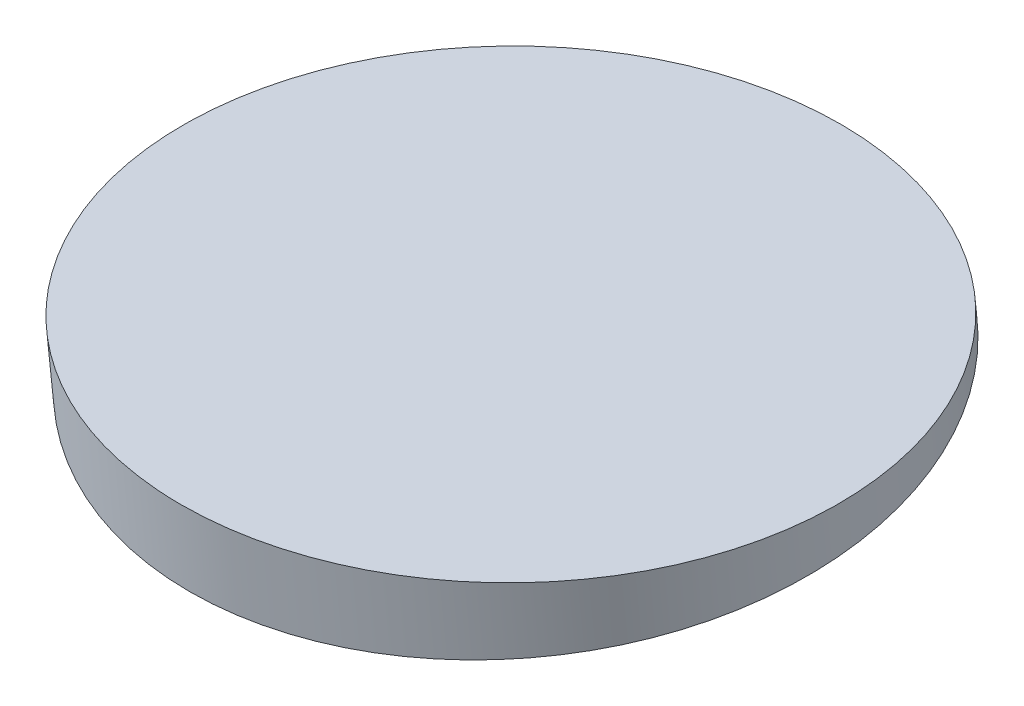
ISO-10303-21;
HEADER;
FILE_DESCRIPTION(('STEP AP214'),'2;1');
FILE_NAME('part.step','',(''),(''),'','','');
FILE_SCHEMA(('AUTOMOTIVE_DESIGN { 1 0 10303 214 1 1 1 1 }'));
ENDSEC;
DATA;
#1=APPLICATION_CONTEXT('core data for automotive mechanical design processes');
#2=APPLICATION_PROTOCOL_DEFINITION('international standard','automotive_design',2000,#1);
#3=PRODUCT_CONTEXT('',#1,'mechanical');
#4=PRODUCT('Part','Part','',(#3));
#5=PRODUCT_RELATED_PRODUCT_CATEGORY('part','',(#4));
#6=PRODUCT_DEFINITION_FORMATION('','',#4);
#7=PRODUCT_DEFINITION_CONTEXT('part definition',#1,'design');
#8=PRODUCT_DEFINITION('design','',#6,#7);
#9=PRODUCT_DEFINITION_SHAPE('','',#8);
#10=(LENGTH_UNIT() NAMED_UNIT(*) SI_UNIT(.MILLI.,.METRE.));
#11=(NAMED_UNIT(*) PLANE_ANGLE_UNIT() SI_UNIT($,.RADIAN.));
#12=(NAMED_UNIT(*) SI_UNIT($,.STERADIAN.) SOLID_ANGLE_UNIT());
#13=UNCERTAINTY_MEASURE_WITH_UNIT(LENGTH_MEASURE(1.E-05),#10,'distance_accuracy_value','');
#14=(GEOMETRIC_REPRESENTATION_CONTEXT(3) GLOBAL_UNCERTAINTY_ASSIGNED_CONTEXT((#13)) GLOBAL_UNIT_ASSIGNED_CONTEXT((#10,
#11,#12)) REPRESENTATION_CONTEXT('',''));
#15=CARTESIAN_POINT('',(0.,0.,0.));
#16=DIRECTION('',(0.,0.,1.));
#17=DIRECTION('',(1.,0.,0.));
#18=AXIS2_PLACEMENT_3D('',#15,#16,#17);
#19=CARTESIAN_POINT('',(-132.804,5386.85755819517,-698.319253830587));
#20=DIRECTION('',(0.,1.,0.));
#21=DIRECTION('',(0.,0.,1.));
#22=AXIS2_PLACEMENT_3D('',#19,#20,#21);
#23=PLANE('',#22);
#24=CARTESIAN_POINT('',(6.53755481226089E-13,5386.85755819517,-698.319253830586));
#25=DIRECTION('',(0.,1.,0.));
#26=DIRECTION('',(1.0650171153038E-12,0.,1.));
#27=AXIS2_PLACEMENT_3D('',#24,#25,#26);
#28=ELLIPSE('',#27,65.3580381716292,64.9999999999999);
#29=CARTESIAN_POINT('',(7.02611847566904E-11,5386.85755819517,-632.961215658956));
#30=VERTEX_POINT('',#29);
#31=EDGE_CURVE('E19',#30,#30,#28,.F.);
#32=ORIENTED_EDGE('',*,*,#31,.F.);
#33=EDGE_LOOP('',(#32));
#34=FACE_BOUND('',#33,.T.);
#35=ADVANCED_FACE('F15',(#34),#23,.T.);
#36=CARTESIAN_POINT('',(-3.48165940522449E-13,5377.90686113686,-699.260009999995));
#37=DIRECTION('',(1.11324602416567E-13,0.994521895368262,0.104528463267758));
#38=DIRECTION('',(0.,-0.104528463267758,0.994521895368262));
#39=AXIS2_PLACEMENT_3D('',#36,#37,#38);
#40=CYLINDRICAL_SURFACE('',#39,64.9999999999999);
#41=ORIENTED_EDGE('',*,*,#31,.T.);
#42=EDGE_LOOP('',(#41));
#43=FACE_BOUND('',#42,.T.);
#44=CARTESIAN_POINT('',(0.,5377.90686113687,-699.260009999995));
#45=DIRECTION('',(-1.11507425654117E-13,0.994521895368264,0.104528463267744));
#46=DIRECTION('',(0.,-0.104528463267744,0.994521895368264));
#47=AXIS2_PLACEMENT_3D('',#44,#45,#46);
#48=CIRCLE('',#47,65.);
#49=CARTESIAN_POINT('',(0.,5371.11251102446,-634.616086801058));
#50=VERTEX_POINT('',#49);
#51=EDGE_CURVE('E10',#50,#50,#48,.F.);
#52=ORIENTED_EDGE('',*,*,#51,.F.);
#53=EDGE_LOOP('',(#52));
#54=FACE_BOUND('',#53,.T.);
#55=ADVANCED_FACE('F28',(#43,#54),#40,.T.);
#56=CARTESIAN_POINT('',(0.,5364.02506310106,-567.183524207508));
#57=DIRECTION('',(0.,-0.994521895368274,-0.104528463267651));
#58=DIRECTION('',(0.,0.104528463267651,-0.994521895368274));
#59=AXIS2_PLACEMENT_3D('',#56,#57,#58);
#60=PLANE('',#59);
#61=ORIENTED_EDGE('',*,*,#51,.T.);
#62=EDGE_LOOP('',(#61));
#63=FACE_BOUND('',#62,.T.);
#64=ADVANCED_FACE('F17',(#63),#60,.T.);
#65=CLOSED_SHELL('',(#35,#55,#64));
#66=MANIFOLD_SOLID_BREP('B1',#65);
#67=ADVANCED_BREP_SHAPE_REPRESENTATION('',(#18,#66),#14);
#68=SHAPE_DEFINITION_REPRESENTATION(#9,#67);
ENDSEC;
END-ISO-10303-21;
